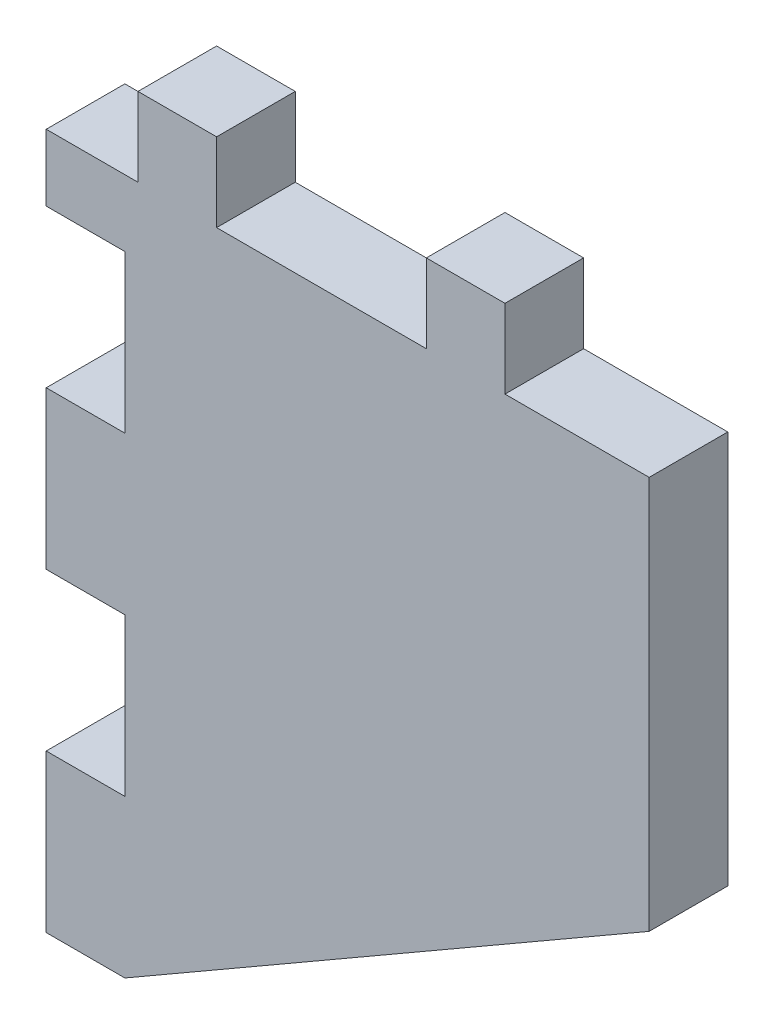
ISO-10303-21;
HEADER;
FILE_DESCRIPTION(('STEP AP214'),'2;1');
FILE_NAME('part.step','',(''),(''),'','','');
FILE_SCHEMA(('AUTOMOTIVE_DESIGN { 1 0 10303 214 1 1 1 1 }'));
ENDSEC;
DATA;
#1=APPLICATION_CONTEXT('core data for automotive mechanical design processes');
#2=APPLICATION_PROTOCOL_DEFINITION('international standard','automotive_design',2000,#1);
#3=PRODUCT_CONTEXT('',#1,'mechanical');
#4=PRODUCT('Part','Part','',(#3));
#5=PRODUCT_RELATED_PRODUCT_CATEGORY('part','',(#4));
#6=PRODUCT_DEFINITION_FORMATION('','',#4);
#7=PRODUCT_DEFINITION_CONTEXT('part definition',#1,'design');
#8=PRODUCT_DEFINITION('design','',#6,#7);
#9=PRODUCT_DEFINITION_SHAPE('','',#8);
#10=(LENGTH_UNIT() NAMED_UNIT(*) SI_UNIT(.MILLI.,.METRE.));
#11=(NAMED_UNIT(*) PLANE_ANGLE_UNIT() SI_UNIT($,.RADIAN.));
#12=(NAMED_UNIT(*) SI_UNIT($,.STERADIAN.) SOLID_ANGLE_UNIT());
#13=UNCERTAINTY_MEASURE_WITH_UNIT(LENGTH_MEASURE(1.E-05),#10,'distance_accuracy_value','');
#14=(GEOMETRIC_REPRESENTATION_CONTEXT(3) GLOBAL_UNCERTAINTY_ASSIGNED_CONTEXT((#13)) GLOBAL_UNIT_ASSIGNED_CONTEXT((#10,
#11,#12)) REPRESENTATION_CONTEXT('',''));
#15=CARTESIAN_POINT('',(0.,0.,0.));
#16=DIRECTION('',(0.,0.,1.));
#17=DIRECTION('',(1.,0.,0.));
#18=AXIS2_PLACEMENT_3D('',#15,#16,#17);
#19=CARTESIAN_POINT('',(-14.1266424451322,14.9295589069163,3.));
#20=DIRECTION('',(0.,-1.,0.));
#21=DIRECTION('',(1.,0.,0.));
#22=AXIS2_PLACEMENT_3D('',#19,#20,#21);
#23=PLANE('',#22);
#24=DIRECTION('',(0.,0.,1.));
#25=VECTOR('',#24,1.);
#26=CARTESIAN_POINT('',(-8.62664244513218,14.9295589069163,0.));
#27=LINE('',#26,#25);
#28=CARTESIAN_POINT('',(-8.62664244513218,14.9295589069163,0.));
#29=VERTEX_POINT('',#28);
#30=CARTESIAN_POINT('',(-8.62664244513218,14.9295589069163,3.));
#31=VERTEX_POINT('',#30);
#32=EDGE_CURVE('E192',#29,#31,#27,.T.);
#33=ORIENTED_EDGE('',*,*,#32,.F.);
#34=DIRECTION('',(-1.,0.,0.));
#35=VECTOR('',#34,1.);
#36=CARTESIAN_POINT('',(-14.1266424451322,14.9295589069163,0.));
#37=LINE('',#36,#35);
#38=CARTESIAN_POINT('',(-16.6266424451322,14.9295589069163,0.));
#39=VERTEX_POINT('',#38);
#40=EDGE_CURVE('E206',#29,#39,#37,.T.);
#41=ORIENTED_EDGE('',*,*,#40,.T.);
#42=DIRECTION('',(0.,0.,1.));
#43=VECTOR('',#42,1.);
#44=CARTESIAN_POINT('',(-16.6266424451322,14.9295589069163,0.));
#45=LINE('',#44,#43);
#46=CARTESIAN_POINT('',(-16.6266424451322,14.9295589069163,3.));
#47=VERTEX_POINT('',#46);
#48=EDGE_CURVE('E669',#39,#47,#45,.T.);
#49=ORIENTED_EDGE('',*,*,#48,.T.);
#50=DIRECTION('',(-1.,0.,0.));
#51=VECTOR('',#50,1.);
#52=CARTESIAN_POINT('',(-3.12664244513218,14.9295589069163,3.));
#53=LINE('',#52,#51);
#54=EDGE_CURVE('E208',#31,#47,#53,.T.);
#55=ORIENTED_EDGE('',*,*,#54,.F.);
#56=EDGE_LOOP('',(#33,#41,#49,#55));
#57=FACE_BOUND('',#56,.T.);
#58=ADVANCED_FACE('F45',(#57),#23,.F.);
#59=DIRECTION('',(0.,0.,1.));
#60=VECTOR('',#59,1.);
#61=CARTESIAN_POINT('',(-19.6266424451322,14.9295589069163,0.));
#62=LINE('',#61,#60);
#63=CARTESIAN_POINT('',(-19.6266424451322,14.9295589069163,0.));
#64=VERTEX_POINT('',#63);
#65=CARTESIAN_POINT('',(-19.6266424451322,14.9295589069163,3.));
#66=VERTEX_POINT('',#65);
#67=EDGE_CURVE('E666',#64,#66,#62,.T.);
#68=ORIENTED_EDGE('',*,*,#67,.F.);
#69=CARTESIAN_POINT('',(-23.1266424451322,14.9295589069163,0.));
#70=VERTEX_POINT('',#69);
#71=EDGE_CURVE('E220',#64,#70,#37,.T.);
#72=ORIENTED_EDGE('',*,*,#71,.T.);
#73=DIRECTION('',(0.,0.,-1.));
#74=VECTOR('',#73,1.);
#75=CARTESIAN_POINT('',(-23.1266424451322,14.9295589069163,3.));
#76=LINE('',#75,#74);
#77=CARTESIAN_POINT('',(-23.1266424451322,14.9295589069163,3.));
#78=VERTEX_POINT('',#77);
#79=EDGE_CURVE('E11',#78,#70,#76,.T.);
#80=ORIENTED_EDGE('',*,*,#79,.F.);
#81=EDGE_CURVE('E266',#66,#78,#53,.T.);
#82=ORIENTED_EDGE('',*,*,#81,.F.);
#83=EDGE_LOOP('',(#68,#72,#80,#82));
#84=FACE_BOUND('',#83,.T.);
#85=ADVANCED_FACE('F392',(#84),#23,.F.);
#86=CARTESIAN_POINT('',(-0.126642445132183,14.9295589069163,0.));
#87=VERTEX_POINT('',#86);
#88=CARTESIAN_POINT('',(-5.62664244513218,14.9295589069163,0.));
#89=VERTEX_POINT('',#88);
#90=EDGE_CURVE('E219',#87,#89,#37,.T.);
#91=ORIENTED_EDGE('',*,*,#90,.T.);
#92=DIRECTION('',(0.,0.,1.));
#93=VECTOR('',#92,1.);
#94=CARTESIAN_POINT('',(-5.62664244513218,14.9295589069163,0.));
#95=LINE('',#94,#93);
#96=CARTESIAN_POINT('',(-5.62664244513218,14.9295589069163,3.));
#97=VERTEX_POINT('',#96);
#98=EDGE_CURVE('E210',#89,#97,#95,.T.);
#99=ORIENTED_EDGE('',*,*,#98,.T.);
#100=CARTESIAN_POINT('',(-0.126642445132183,14.9295589069163,3.));
#101=VERTEX_POINT('',#100);
#102=EDGE_CURVE('E371',#101,#97,#53,.T.);
#103=ORIENTED_EDGE('',*,*,#102,.F.);
#104=DIRECTION('',(0.,0.,-1.));
#105=VECTOR('',#104,1.);
#106=CARTESIAN_POINT('',(-0.126642445132183,14.9295589069163,3.));
#107=LINE('',#106,#105);
#108=EDGE_CURVE('E267',#101,#87,#107,.T.);
#109=ORIENTED_EDGE('',*,*,#108,.T.);
#110=EDGE_LOOP('',(#91,#99,#103,#109));
#111=FACE_BOUND('',#110,.T.);
#112=ADVANCED_FACE('F47',(#111),#23,.F.);
#113=CARTESIAN_POINT('',(-23.1266424451322,14.9295589069163,3.));
#114=DIRECTION('',(1.,0.,0.));
#115=DIRECTION('',(0.,0.,-1.));
#116=AXIS2_PLACEMENT_3D('',#113,#114,#115);
#117=PLANE('',#116);
#118=DIRECTION('',(0.,-1.,0.));
#119=VECTOR('',#118,1.);
#120=CARTESIAN_POINT('',(-23.1266424451322,14.9295589069163,0.));
#121=LINE('',#120,#119);
#122=CARTESIAN_POINT('',(-23.1266424451322,12.3895589069163,0.));
#123=VERTEX_POINT('',#122);
#124=EDGE_CURVE('E225',#70,#123,#121,.T.);
#125=ORIENTED_EDGE('',*,*,#124,.T.);
#126=DIRECTION('',(0.,0.,-1.));
#127=VECTOR('',#126,1.);
#128=CARTESIAN_POINT('',(-23.1266424451322,12.3895589069163,3.));
#129=LINE('',#128,#127);
#130=CARTESIAN_POINT('',(-23.1266424451322,12.3895589069163,3.));
#131=VERTEX_POINT('',#130);
#132=EDGE_CURVE('E54',#131,#123,#129,.T.);
#133=ORIENTED_EDGE('',*,*,#132,.F.);
#134=DIRECTION('',(0.,-1.,0.));
#135=VECTOR('',#134,1.);
#136=CARTESIAN_POINT('',(-23.1266424451322,14.9295589069163,3.));
#137=LINE('',#136,#135);
#138=EDGE_CURVE('E377',#78,#131,#137,.T.);
#139=ORIENTED_EDGE('',*,*,#138,.F.);
#140=ORIENTED_EDGE('',*,*,#79,.T.);
#141=EDGE_LOOP('',(#125,#133,#139,#140));
#142=FACE_BOUND('',#141,.T.);
#143=ADVANCED_FACE('F393',(#142),#117,.F.);
#144=CARTESIAN_POINT('',(-23.1266424451322,12.3895589069163,3.));
#145=DIRECTION('',(0.,1.,0.));
#146=DIRECTION('',(0.,0.,1.));
#147=AXIS2_PLACEMENT_3D('',#144,#145,#146);
#148=PLANE('',#147);
#149=DIRECTION('',(1.,0.,0.));
#150=VECTOR('',#149,1.);
#151=CARTESIAN_POINT('',(-23.1266424451322,12.3895589069163,0.));
#152=LINE('',#151,#150);
#153=CARTESIAN_POINT('',(-20.1266424451322,12.3895589069163,0.));
#154=VERTEX_POINT('',#153);
#155=EDGE_CURVE('E232',#123,#154,#152,.T.);
#156=ORIENTED_EDGE('',*,*,#155,.T.);
#157=DIRECTION('',(0.,0.,-1.));
#158=VECTOR('',#157,1.);
#159=CARTESIAN_POINT('',(-20.1266424451322,12.3895589069163,3.));
#160=LINE('',#159,#158);
#161=CARTESIAN_POINT('',(-20.1266424451322,12.3895589069163,3.));
#162=VERTEX_POINT('',#161);
#163=EDGE_CURVE('E307',#162,#154,#160,.T.);
#164=ORIENTED_EDGE('',*,*,#163,.F.);
#165=DIRECTION('',(1.,0.,0.));
#166=VECTOR('',#165,1.);
#167=CARTESIAN_POINT('',(-23.1266424451322,12.3895589069163,3.));
#168=LINE('',#167,#166);
#169=EDGE_CURVE('E318',#131,#162,#168,.T.);
#170=ORIENTED_EDGE('',*,*,#169,.F.);
#171=ORIENTED_EDGE('',*,*,#132,.T.);
#172=EDGE_LOOP('',(#156,#164,#170,#171));
#173=FACE_BOUND('',#172,.T.);
#174=ADVANCED_FACE('F316',(#173),#148,.F.);
#175=CARTESIAN_POINT('',(-20.1266424451322,12.3895589069163,3.));
#176=DIRECTION('',(1.,0.,0.));
#177=DIRECTION('',(0.,0.,-1.));
#178=AXIS2_PLACEMENT_3D('',#175,#176,#177);
#179=PLANE('',#178);
#180=DIRECTION('',(0.,-1.,0.));
#181=VECTOR('',#180,1.);
#182=CARTESIAN_POINT('',(-20.1266424451322,12.3895589069163,0.));
#183=LINE('',#182,#181);
#184=CARTESIAN_POINT('',(-20.1266424451322,6.38955890691629,0.));
#185=VERTEX_POINT('',#184);
#186=EDGE_CURVE('E235',#154,#185,#183,.T.);
#187=ORIENTED_EDGE('',*,*,#186,.T.);
#188=DIRECTION('',(0.,0.,-1.));
#189=VECTOR('',#188,1.);
#190=CARTESIAN_POINT('',(-20.1266424451322,6.38955890691629,3.));
#191=LINE('',#190,#189);
#192=CARTESIAN_POINT('',(-20.1266424451322,6.38955890691629,3.));
#193=VERTEX_POINT('',#192);
#194=EDGE_CURVE('E303',#193,#185,#191,.T.);
#195=ORIENTED_EDGE('',*,*,#194,.F.);
#196=DIRECTION('',(0.,-1.,0.));
#197=VECTOR('',#196,1.);
#198=CARTESIAN_POINT('',(-20.1266424451322,12.3895589069163,3.));
#199=LINE('',#198,#197);
#200=EDGE_CURVE('E339',#162,#193,#199,.T.);
#201=ORIENTED_EDGE('',*,*,#200,.F.);
#202=ORIENTED_EDGE('',*,*,#163,.T.);
#203=EDGE_LOOP('',(#187,#195,#201,#202));
#204=FACE_BOUND('',#203,.T.);
#205=ADVANCED_FACE('F328',(#204),#179,.F.);
#206=CARTESIAN_POINT('',(-20.1266424451322,6.38955890691629,3.));
#207=DIRECTION('',(0.,-1.,0.));
#208=DIRECTION('',(1.,0.,0.));
#209=AXIS2_PLACEMENT_3D('',#206,#207,#208);
#210=PLANE('',#209);
#211=DIRECTION('',(-1.,0.,0.));
#212=VECTOR('',#211,1.);
#213=CARTESIAN_POINT('',(-20.1266424451322,6.38955890691629,0.));
#214=LINE('',#213,#212);
#215=CARTESIAN_POINT('',(-23.1266424451322,6.38955890691629,0.));
#216=VERTEX_POINT('',#215);
#217=EDGE_CURVE('E238',#185,#216,#214,.T.);
#218=ORIENTED_EDGE('',*,*,#217,.T.);
#219=DIRECTION('',(0.,0.,-1.));
#220=VECTOR('',#219,1.);
#221=CARTESIAN_POINT('',(-23.1266424451322,6.38955890691629,3.));
#222=LINE('',#221,#220);
#223=CARTESIAN_POINT('',(-23.1266424451322,6.38955890691629,3.));
#224=VERTEX_POINT('',#223);
#225=EDGE_CURVE('E299',#224,#216,#222,.T.);
#226=ORIENTED_EDGE('',*,*,#225,.F.);
#227=DIRECTION('',(-1.,0.,0.));
#228=VECTOR('',#227,1.);
#229=CARTESIAN_POINT('',(-20.1266424451322,6.38955890691629,3.));
#230=LINE('',#229,#228);
#231=EDGE_CURVE('E334',#193,#224,#230,.T.);
#232=ORIENTED_EDGE('',*,*,#231,.F.);
#233=ORIENTED_EDGE('',*,*,#194,.T.);
#234=EDGE_LOOP('',(#218,#226,#232,#233));
#235=FACE_BOUND('',#234,.T.);
#236=ADVANCED_FACE('F332',(#235),#210,.F.);
#237=CARTESIAN_POINT('',(-23.1266424451322,6.38955890691629,3.));
#238=DIRECTION('',(1.,0.,0.));
#239=DIRECTION('',(0.,0.,-1.));
#240=AXIS2_PLACEMENT_3D('',#237,#238,#239);
#241=PLANE('',#240);
#242=DIRECTION('',(0.,-1.,0.));
#243=VECTOR('',#242,1.);
#244=CARTESIAN_POINT('',(-23.1266424451322,6.38955890691629,0.));
#245=LINE('',#244,#243);
#246=CARTESIAN_POINT('',(-23.1266424451322,0.38955890691629,0.));
#247=VERTEX_POINT('',#246);
#248=EDGE_CURVE('E241',#216,#247,#245,.T.);
#249=ORIENTED_EDGE('',*,*,#248,.T.);
#250=DIRECTION('',(0.,0.,-1.));
#251=VECTOR('',#250,1.);
#252=CARTESIAN_POINT('',(-23.1266424451322,0.38955890691629,3.));
#253=LINE('',#252,#251);
#254=CARTESIAN_POINT('',(-23.1266424451322,0.38955890691629,3.));
#255=VERTEX_POINT('',#254);
#256=EDGE_CURVE('E295',#255,#247,#253,.T.);
#257=ORIENTED_EDGE('',*,*,#256,.F.);
#258=DIRECTION('',(0.,-1.,0.));
#259=VECTOR('',#258,1.);
#260=CARTESIAN_POINT('',(-23.1266424451322,6.38955890691629,3.));
#261=LINE('',#260,#259);
#262=EDGE_CURVE('E338',#224,#255,#261,.T.);
#263=ORIENTED_EDGE('',*,*,#262,.F.);
#264=ORIENTED_EDGE('',*,*,#225,.T.);
#265=EDGE_LOOP('',(#249,#257,#263,#264));
#266=FACE_BOUND('',#265,.T.);
#267=ADVANCED_FACE('F564',(#266),#241,.F.);
#268=CARTESIAN_POINT('',(-23.1266424451322,0.38955890691629,3.));
#269=DIRECTION('',(0.,1.,0.));
#270=DIRECTION('',(0.,0.,1.));
#271=AXIS2_PLACEMENT_3D('',#268,#269,#270);
#272=PLANE('',#271);
#273=DIRECTION('',(1.,0.,0.));
#274=VECTOR('',#273,1.);
#275=CARTESIAN_POINT('',(-23.1266424451322,0.38955890691629,0.));
#276=LINE('',#275,#274);
#277=CARTESIAN_POINT('',(-20.1266424451322,0.38955890691629,0.));
#278=VERTEX_POINT('',#277);
#279=EDGE_CURVE('E244',#247,#278,#276,.T.);
#280=ORIENTED_EDGE('',*,*,#279,.T.);
#281=DIRECTION('',(0.,0.,-1.));
#282=VECTOR('',#281,1.);
#283=CARTESIAN_POINT('',(-20.1266424451322,0.38955890691629,3.));
#284=LINE('',#283,#282);
#285=CARTESIAN_POINT('',(-20.1266424451322,0.38955890691629,3.));
#286=VERTEX_POINT('',#285);
#287=EDGE_CURVE('E291',#286,#278,#284,.T.);
#288=ORIENTED_EDGE('',*,*,#287,.F.);
#289=DIRECTION('',(1.,0.,0.));
#290=VECTOR('',#289,1.);
#291=CARTESIAN_POINT('',(-23.1266424451322,0.38955890691629,3.));
#292=LINE('',#291,#290);
#293=EDGE_CURVE('E343',#255,#286,#292,.T.);
#294=ORIENTED_EDGE('',*,*,#293,.F.);
#295=ORIENTED_EDGE('',*,*,#256,.T.);
#296=EDGE_LOOP('',(#280,#288,#294,#295));
#297=FACE_BOUND('',#296,.T.);
#298=ADVANCED_FACE('F555',(#297),#272,.F.);
#299=CARTESIAN_POINT('',(-20.1266424451322,0.38955890691629,3.));
#300=DIRECTION('',(1.,0.,0.));
#301=DIRECTION('',(0.,0.,-1.));
#302=AXIS2_PLACEMENT_3D('',#299,#300,#301);
#303=PLANE('',#302);
#304=DIRECTION('',(0.,-1.,0.));
#305=VECTOR('',#304,1.);
#306=CARTESIAN_POINT('',(-20.1266424451322,0.38955890691629,0.));
#307=LINE('',#306,#305);
#308=CARTESIAN_POINT('',(-20.1266424451322,-5.6104410930837,0.));
#309=VERTEX_POINT('',#308);
#310=EDGE_CURVE('E247',#278,#309,#307,.T.);
#311=ORIENTED_EDGE('',*,*,#310,.T.);
#312=DIRECTION('',(0.,0.,-1.));
#313=VECTOR('',#312,1.);
#314=CARTESIAN_POINT('',(-20.1266424451322,-5.6104410930837,3.));
#315=LINE('',#314,#313);
#316=CARTESIAN_POINT('',(-20.1266424451322,-5.6104410930837,3.));
#317=VERTEX_POINT('',#316);
#318=EDGE_CURVE('E287',#317,#309,#315,.T.);
#319=ORIENTED_EDGE('',*,*,#318,.F.);
#320=DIRECTION('',(0.,-1.,0.));
#321=VECTOR('',#320,1.);
#322=CARTESIAN_POINT('',(-20.1266424451322,0.38955890691629,3.));
#323=LINE('',#322,#321);
#324=EDGE_CURVE('E350',#286,#317,#323,.T.);
#325=ORIENTED_EDGE('',*,*,#324,.F.);
#326=ORIENTED_EDGE('',*,*,#287,.T.);
#327=EDGE_LOOP('',(#311,#319,#325,#326));
#328=FACE_BOUND('',#327,.T.);
#329=ADVANCED_FACE('F546',(#328),#303,.F.);
#330=CARTESIAN_POINT('',(-20.1266424451322,-5.6104410930837,3.));
#331=DIRECTION('',(0.,-1.,0.));
#332=DIRECTION('',(1.,0.,0.));
#333=AXIS2_PLACEMENT_3D('',#330,#331,#332);
#334=PLANE('',#333);
#335=DIRECTION('',(-1.,0.,0.));
#336=VECTOR('',#335,1.);
#337=CARTESIAN_POINT('',(-20.1266424451322,-5.6104410930837,0.));
#338=LINE('',#337,#336);
#339=CARTESIAN_POINT('',(-23.1266424451322,-5.61044109308371,0.));
#340=VERTEX_POINT('',#339);
#341=EDGE_CURVE('E250',#309,#340,#338,.T.);
#342=ORIENTED_EDGE('',*,*,#341,.T.);
#343=DIRECTION('',(0.,0.,-1.));
#344=VECTOR('',#343,1.);
#345=CARTESIAN_POINT('',(-23.1266424451322,-5.61044109308371,3.));
#346=LINE('',#345,#344);
#347=CARTESIAN_POINT('',(-23.1266424451322,-5.61044109308371,3.));
#348=VERTEX_POINT('',#347);
#349=EDGE_CURVE('E283',#348,#340,#346,.T.);
#350=ORIENTED_EDGE('',*,*,#349,.F.);
#351=DIRECTION('',(-1.,0.,0.));
#352=VECTOR('',#351,1.);
#353=CARTESIAN_POINT('',(-20.1266424451322,-5.6104410930837,3.));
#354=LINE('',#353,#352);
#355=EDGE_CURVE('E353',#317,#348,#354,.T.);
#356=ORIENTED_EDGE('',*,*,#355,.F.);
#357=ORIENTED_EDGE('',*,*,#318,.T.);
#358=EDGE_LOOP('',(#342,#350,#356,#357));
#359=FACE_BOUND('',#358,.T.);
#360=ADVANCED_FACE('F537',(#359),#334,.F.);
#361=CARTESIAN_POINT('',(-23.1266424451322,-5.61044109308371,3.));
#362=DIRECTION('',(1.,0.,0.));
#363=DIRECTION('',(0.,0.,-1.));
#364=AXIS2_PLACEMENT_3D('',#361,#362,#363);
#365=PLANE('',#364);
#366=DIRECTION('',(0.,-1.,0.));
#367=VECTOR('',#366,1.);
#368=CARTESIAN_POINT('',(-23.1266424451322,-5.61044109308371,0.));
#369=LINE('',#368,#367);
#370=CARTESIAN_POINT('',(-23.1266424451322,-11.6104410930837,0.));
#371=VERTEX_POINT('',#370);
#372=EDGE_CURVE('E253',#340,#371,#369,.T.);
#373=ORIENTED_EDGE('',*,*,#372,.T.);
#374=DIRECTION('',(0.,0.,-1.));
#375=VECTOR('',#374,1.);
#376=CARTESIAN_POINT('',(-23.1266424451322,-11.6104410930837,3.));
#377=LINE('',#376,#375);
#378=CARTESIAN_POINT('',(-23.1266424451322,-11.6104410930837,3.));
#379=VERTEX_POINT('',#378);
#380=EDGE_CURVE('E279',#379,#371,#377,.T.);
#381=ORIENTED_EDGE('',*,*,#380,.F.);
#382=DIRECTION('',(0.,-1.,0.));
#383=VECTOR('',#382,1.);
#384=CARTESIAN_POINT('',(-23.1266424451322,-5.61044109308371,3.));
#385=LINE('',#384,#383);
#386=EDGE_CURVE('E356',#348,#379,#385,.T.);
#387=ORIENTED_EDGE('',*,*,#386,.F.);
#388=ORIENTED_EDGE('',*,*,#349,.T.);
#389=EDGE_LOOP('',(#373,#381,#387,#388));
#390=FACE_BOUND('',#389,.T.);
#391=ADVANCED_FACE('F528',(#390),#365,.F.);
#392=CARTESIAN_POINT('',(-23.1266424451322,-11.6104410930837,3.));
#393=DIRECTION('',(0.,1.,0.));
#394=DIRECTION('',(0.,0.,1.));
#395=AXIS2_PLACEMENT_3D('',#392,#393,#394);
#396=PLANE('',#395);
#397=DIRECTION('',(1.,0.,0.));
#398=VECTOR('',#397,1.);
#399=CARTESIAN_POINT('',(-23.1266424451322,-11.6104410930837,0.));
#400=LINE('',#399,#398);
#401=CARTESIAN_POINT('',(-20.1266424451322,-11.6104410930837,0.));
#402=VERTEX_POINT('',#401);
#403=EDGE_CURVE('E256',#371,#402,#400,.T.);
#404=ORIENTED_EDGE('',*,*,#403,.T.);
#405=DIRECTION('',(0.,0.,-1.));
#406=VECTOR('',#405,1.);
#407=CARTESIAN_POINT('',(-20.1266424451322,-11.6104410930837,3.));
#408=LINE('',#407,#406);
#409=CARTESIAN_POINT('',(-20.1266424451322,-11.6104410930837,3.));
#410=VERTEX_POINT('',#409);
#411=EDGE_CURVE('E275',#410,#402,#408,.T.);
#412=ORIENTED_EDGE('',*,*,#411,.F.);
#413=DIRECTION('',(1.,0.,0.));
#414=VECTOR('',#413,1.);
#415=CARTESIAN_POINT('',(-23.1266424451322,-11.6104410930837,3.));
#416=LINE('',#415,#414);
#417=EDGE_CURVE('E359',#379,#410,#416,.T.);
#418=ORIENTED_EDGE('',*,*,#417,.F.);
#419=ORIENTED_EDGE('',*,*,#380,.T.);
#420=EDGE_LOOP('',(#404,#412,#418,#419));
#421=FACE_BOUND('',#420,.T.);
#422=ADVANCED_FACE('F519',(#421),#396,.F.);
#423=CARTESIAN_POINT('',(-20.1266424451322,-11.6104410930837,3.));
#424=DIRECTION('',(-0.499772441725888,0.866156744758905,0.));
#425=DIRECTION('',(-0.866156744758905,-0.499772441725889,0.));
#426=AXIS2_PLACEMENT_3D('',#423,#424,#425);
#427=PLANE('',#426);
#428=DIRECTION('',(0.866156744758905,0.499772441725889,0.));
#429=VECTOR('',#428,1.);
#430=CARTESIAN_POINT('',(-20.1266424451322,-11.6104410930837,0.));
#431=LINE('',#430,#429);
#432=CARTESIAN_POINT('',(-0.126642445132181,-0.0704410930837084,0.));
#433=VERTEX_POINT('',#432);
#434=EDGE_CURVE('E259',#402,#433,#431,.T.);
#435=ORIENTED_EDGE('',*,*,#434,.T.);
#436=DIRECTION('',(0.,0.,-1.));
#437=VECTOR('',#436,1.);
#438=CARTESIAN_POINT('',(-0.126642445132181,-0.0704410930837084,3.));
#439=LINE('',#438,#437);
#440=CARTESIAN_POINT('',(-0.126642445132181,-0.0704410930837084,3.));
#441=VERTEX_POINT('',#440);
#442=EDGE_CURVE('E271',#441,#433,#439,.T.);
#443=ORIENTED_EDGE('',*,*,#442,.F.);
#444=DIRECTION('',(0.866156744758905,0.499772441725889,0.));
#445=VECTOR('',#444,1.);
#446=CARTESIAN_POINT('',(-20.1266424451322,-11.6104410930837,3.));
#447=LINE('',#446,#445);
#448=EDGE_CURVE('E361',#410,#441,#447,.T.);
#449=ORIENTED_EDGE('',*,*,#448,.F.);
#450=ORIENTED_EDGE('',*,*,#411,.T.);
#451=EDGE_LOOP('',(#435,#443,#449,#450));
#452=FACE_BOUND('',#451,.T.);
#453=ADVANCED_FACE('F511',(#452),#427,.F.);
#454=CARTESIAN_POINT('',(-0.126642445132183,14.9295589069163,3.));
#455=DIRECTION('',(-1.,0.,0.));
#456=DIRECTION('',(0.,-1.,0.));
#457=AXIS2_PLACEMENT_3D('',#454,#455,#456);
#458=PLANE('',#457);
#459=DIRECTION('',(0.,1.,0.));
#460=VECTOR('',#459,1.);
#461=CARTESIAN_POINT('',(-0.126642445132183,14.9295589069163,0.));
#462=LINE('',#461,#460);
#463=EDGE_CURVE('E262',#433,#87,#462,.T.);
#464=ORIENTED_EDGE('',*,*,#463,.T.);
#465=ORIENTED_EDGE('',*,*,#108,.F.);
#466=DIRECTION('',(0.,1.,0.));
#467=VECTOR('',#466,1.);
#468=CARTESIAN_POINT('',(-0.126642445132183,14.9295589069163,3.));
#469=LINE('',#468,#467);
#470=EDGE_CURVE('E228',#441,#101,#469,.T.);
#471=ORIENTED_EDGE('',*,*,#470,.F.);
#472=ORIENTED_EDGE('',*,*,#442,.T.);
#473=EDGE_LOOP('',(#464,#465,#471,#472));
#474=FACE_BOUND('',#473,.T.);
#475=ADVANCED_FACE('F373',(#474),#458,.F.);
#476=CARTESIAN_POINT('',(0.,0.,3.));
#477=DIRECTION('',(0.,0.,-1.));
#478=DIRECTION('',(-1.,0.,0.));
#479=AXIS2_PLACEMENT_3D('',#476,#477,#478);
#480=PLANE('',#479);
#481=ORIENTED_EDGE('',*,*,#102,.T.);
#482=DIRECTION('',(0.,1.,0.));
#483=VECTOR('',#482,1.);
#484=CARTESIAN_POINT('',(-5.62664244513218,14.9295589069163,3.));
#485=LINE('',#484,#483);
#486=CARTESIAN_POINT('',(-5.62664244513218,17.9295589069163,3.));
#487=VERTEX_POINT('',#486);
#488=EDGE_CURVE('E69',#97,#487,#485,.T.);
#489=ORIENTED_EDGE('',*,*,#488,.T.);
#490=DIRECTION('',(-1.,0.,0.));
#491=VECTOR('',#490,1.);
#492=CARTESIAN_POINT('',(-5.62664244513218,17.9295589069163,3.));
#493=LINE('',#492,#491);
#494=CARTESIAN_POINT('',(-8.62664244513218,17.9295589069163,3.));
#495=VERTEX_POINT('',#494);
#496=EDGE_CURVE('E201',#487,#495,#493,.T.);
#497=ORIENTED_EDGE('',*,*,#496,.T.);
#498=DIRECTION('',(0.,-1.,0.));
#499=VECTOR('',#498,1.);
#500=CARTESIAN_POINT('',(-8.62664244513218,14.9295589069163,3.));
#501=LINE('',#500,#499);
#502=EDGE_CURVE('E644',#495,#31,#501,.T.);
#503=ORIENTED_EDGE('',*,*,#502,.T.);
#504=ORIENTED_EDGE('',*,*,#54,.T.);
#505=DIRECTION('',(0.,1.,0.));
#506=VECTOR('',#505,1.);
#507=CARTESIAN_POINT('',(-16.6266424451322,14.9295589069163,3.));
#508=LINE('',#507,#506);
#509=CARTESIAN_POINT('',(-16.6266424451322,17.9295589069163,3.));
#510=VERTEX_POINT('',#509);
#511=EDGE_CURVE('E61',#47,#510,#508,.T.);
#512=ORIENTED_EDGE('',*,*,#511,.T.);
#513=DIRECTION('',(-1.,0.,0.));
#514=VECTOR('',#513,1.);
#515=CARTESIAN_POINT('',(-16.6266424451322,17.9295589069163,3.));
#516=LINE('',#515,#514);
#517=CARTESIAN_POINT('',(-19.6266424451322,17.9295589069163,3.));
#518=VERTEX_POINT('',#517);
#519=EDGE_CURVE('E674',#510,#518,#516,.T.);
#520=ORIENTED_EDGE('',*,*,#519,.T.);
#521=DIRECTION('',(0.,-1.,0.));
#522=VECTOR('',#521,1.);
#523=CARTESIAN_POINT('',(-19.6266424451322,14.9295589069163,3.));
#524=LINE('',#523,#522);
#525=EDGE_CURVE('E389',#518,#66,#524,.T.);
#526=ORIENTED_EDGE('',*,*,#525,.T.);
#527=ORIENTED_EDGE('',*,*,#81,.T.);
#528=ORIENTED_EDGE('',*,*,#138,.T.);
#529=ORIENTED_EDGE('',*,*,#169,.T.);
#530=ORIENTED_EDGE('',*,*,#200,.T.);
#531=ORIENTED_EDGE('',*,*,#231,.T.);
#532=ORIENTED_EDGE('',*,*,#262,.T.);
#533=ORIENTED_EDGE('',*,*,#293,.T.);
#534=ORIENTED_EDGE('',*,*,#324,.T.);
#535=ORIENTED_EDGE('',*,*,#355,.T.);
#536=ORIENTED_EDGE('',*,*,#386,.T.);
#537=ORIENTED_EDGE('',*,*,#417,.T.);
#538=ORIENTED_EDGE('',*,*,#448,.T.);
#539=ORIENTED_EDGE('',*,*,#470,.T.);
#540=EDGE_LOOP('',(#481,#489,#497,#503,#504,#512,#520,#526,#527,#528,#529,#530,#531,#532,#533,
#534,#535,#536,#537,#538,#539));
#541=FACE_BOUND('',#540,.T.);
#542=ADVANCED_FACE('F369',(#541),#480,.F.);
#543=CARTESIAN_POINT('',(0.,0.,0.));
#544=DIRECTION('',(0.,0.,-1.));
#545=DIRECTION('',(-1.,0.,0.));
#546=AXIS2_PLACEMENT_3D('',#543,#544,#545);
#547=PLANE('',#546);
#548=ORIENTED_EDGE('',*,*,#90,.F.);
#549=ORIENTED_EDGE('',*,*,#463,.F.);
#550=ORIENTED_EDGE('',*,*,#434,.F.);
#551=ORIENTED_EDGE('',*,*,#403,.F.);
#552=ORIENTED_EDGE('',*,*,#372,.F.);
#553=ORIENTED_EDGE('',*,*,#341,.F.);
#554=ORIENTED_EDGE('',*,*,#310,.F.);
#555=ORIENTED_EDGE('',*,*,#279,.F.);
#556=ORIENTED_EDGE('',*,*,#248,.F.);
#557=ORIENTED_EDGE('',*,*,#217,.F.);
#558=ORIENTED_EDGE('',*,*,#186,.F.);
#559=ORIENTED_EDGE('',*,*,#155,.F.);
#560=ORIENTED_EDGE('',*,*,#124,.F.);
#561=ORIENTED_EDGE('',*,*,#71,.F.);
#562=DIRECTION('',(0.,-1.,0.));
#563=VECTOR('',#562,1.);
#564=CARTESIAN_POINT('',(-19.6266424451322,14.9295589069163,0.));
#565=LINE('',#564,#563);
#566=CARTESIAN_POINT('',(-19.6266424451322,17.9295589069163,0.));
#567=VERTEX_POINT('',#566);
#568=EDGE_CURVE('E662',#567,#64,#565,.T.);
#569=ORIENTED_EDGE('',*,*,#568,.F.);
#570=DIRECTION('',(-1.,0.,0.));
#571=VECTOR('',#570,1.);
#572=CARTESIAN_POINT('',(-16.6266424451322,17.9295589069163,0.));
#573=LINE('',#572,#571);
#574=CARTESIAN_POINT('',(-16.6266424451322,17.9295589069163,0.));
#575=VERTEX_POINT('',#574);
#576=EDGE_CURVE('E681',#575,#567,#573,.T.);
#577=ORIENTED_EDGE('',*,*,#576,.F.);
#578=DIRECTION('',(0.,1.,0.));
#579=VECTOR('',#578,1.);
#580=CARTESIAN_POINT('',(-16.6266424451322,14.9295589069163,0.));
#581=LINE('',#580,#579);
#582=EDGE_CURVE('E217',#39,#575,#581,.T.);
#583=ORIENTED_EDGE('',*,*,#582,.F.);
#584=ORIENTED_EDGE('',*,*,#40,.F.);
#585=DIRECTION('',(0.,-1.,0.));
#586=VECTOR('',#585,1.);
#587=CARTESIAN_POINT('',(-8.62664244513218,14.9295589069163,0.));
#588=LINE('',#587,#586);
#589=CARTESIAN_POINT('',(-8.62664244513218,17.9295589069163,0.));
#590=VERTEX_POINT('',#589);
#591=EDGE_CURVE('E188',#590,#29,#588,.T.);
#592=ORIENTED_EDGE('',*,*,#591,.F.);
#593=DIRECTION('',(-1.,0.,0.));
#594=VECTOR('',#593,1.);
#595=CARTESIAN_POINT('',(-5.62664244513218,17.9295589069163,0.));
#596=LINE('',#595,#594);
#597=CARTESIAN_POINT('',(-5.62664244513218,17.9295589069163,0.));
#598=VERTEX_POINT('',#597);
#599=EDGE_CURVE('E211',#598,#590,#596,.T.);
#600=ORIENTED_EDGE('',*,*,#599,.F.);
#601=DIRECTION('',(0.,1.,0.));
#602=VECTOR('',#601,1.);
#603=CARTESIAN_POINT('',(-5.62664244513218,14.9295589069163,0.));
#604=LINE('',#603,#602);
#605=EDGE_CURVE('E200',#89,#598,#604,.T.);
#606=ORIENTED_EDGE('',*,*,#605,.F.);
#607=EDGE_LOOP('',(#548,#549,#550,#551,#552,#553,#554,#555,#556,#557,#558,#559,#560,#561,#569,
#577,#583,#584,#592,#600,#606));
#608=FACE_BOUND('',#607,.T.);
#609=ADVANCED_FACE('F214',(#608),#547,.T.);
#610=CARTESIAN_POINT('',(-16.6266424451322,14.9295589069163,0.));
#611=DIRECTION('',(1.,0.,0.));
#612=DIRECTION('',(0.,0.,-1.));
#613=AXIS2_PLACEMENT_3D('',#610,#611,#612);
#614=PLANE('',#613);
#615=ORIENTED_EDGE('',*,*,#511,.F.);
#616=ORIENTED_EDGE('',*,*,#48,.F.);
#617=ORIENTED_EDGE('',*,*,#582,.T.);
#618=DIRECTION('',(0.,0.,1.));
#619=VECTOR('',#618,1.);
#620=CARTESIAN_POINT('',(-16.6266424451322,17.9295589069163,0.));
#621=LINE('',#620,#619);
#622=EDGE_CURVE('E659',#575,#510,#621,.T.);
#623=ORIENTED_EDGE('',*,*,#622,.T.);
#624=EDGE_LOOP('',(#615,#616,#617,#623));
#625=FACE_BOUND('',#624,.T.);
#626=ADVANCED_FACE('F428',(#625),#614,.T.);
#627=CARTESIAN_POINT('',(-19.6266424451322,14.9295589069163,0.));
#628=DIRECTION('',(-1.,0.,0.));
#629=DIRECTION('',(0.,0.,1.));
#630=AXIS2_PLACEMENT_3D('',#627,#628,#629);
#631=PLANE('',#630);
#632=ORIENTED_EDGE('',*,*,#525,.F.);
#633=DIRECTION('',(0.,0.,1.));
#634=VECTOR('',#633,1.);
#635=CARTESIAN_POINT('',(-19.6266424451322,17.9295589069163,0.));
#636=LINE('',#635,#634);
#637=EDGE_CURVE('E663',#567,#518,#636,.T.);
#638=ORIENTED_EDGE('',*,*,#637,.F.);
#639=ORIENTED_EDGE('',*,*,#568,.T.);
#640=ORIENTED_EDGE('',*,*,#67,.T.);
#641=EDGE_LOOP('',(#632,#638,#639,#640));
#642=FACE_BOUND('',#641,.T.);
#643=ADVANCED_FACE('F435',(#642),#631,.T.);
#644=CARTESIAN_POINT('',(-16.6266424451322,17.9295589069163,0.));
#645=DIRECTION('',(0.,1.,0.));
#646=DIRECTION('',(0.,0.,1.));
#647=AXIS2_PLACEMENT_3D('',#644,#645,#646);
#648=PLANE('',#647);
#649=ORIENTED_EDGE('',*,*,#519,.F.);
#650=ORIENTED_EDGE('',*,*,#622,.F.);
#651=ORIENTED_EDGE('',*,*,#576,.T.);
#652=ORIENTED_EDGE('',*,*,#637,.T.);
#653=EDGE_LOOP('',(#649,#650,#651,#652));
#654=FACE_BOUND('',#653,.T.);
#655=ADVANCED_FACE('F443',(#654),#648,.T.);
#656=CARTESIAN_POINT('',(-8.62664244513218,14.9295589069163,0.));
#657=DIRECTION('',(-1.,0.,0.));
#658=DIRECTION('',(0.,0.,1.));
#659=AXIS2_PLACEMENT_3D('',#656,#657,#658);
#660=PLANE('',#659);
#661=ORIENTED_EDGE('',*,*,#502,.F.);
#662=DIRECTION('',(0.,0.,1.));
#663=VECTOR('',#662,1.);
#664=CARTESIAN_POINT('',(-8.62664244513218,17.9295589069163,0.));
#665=LINE('',#664,#663);
#666=EDGE_CURVE('E194',#590,#495,#665,.T.);
#667=ORIENTED_EDGE('',*,*,#666,.F.);
#668=ORIENTED_EDGE('',*,*,#591,.T.);
#669=ORIENTED_EDGE('',*,*,#32,.T.);
#670=EDGE_LOOP('',(#661,#667,#668,#669));
#671=FACE_BOUND('',#670,.T.);
#672=ADVANCED_FACE('F191',(#671),#660,.T.);
#673=CARTESIAN_POINT('',(-5.62664244513218,17.9295589069163,0.));
#674=DIRECTION('',(0.,1.,0.));
#675=DIRECTION('',(0.,0.,1.));
#676=AXIS2_PLACEMENT_3D('',#673,#674,#675);
#677=PLANE('',#676);
#678=ORIENTED_EDGE('',*,*,#496,.F.);
#679=DIRECTION('',(0.,0.,1.));
#680=VECTOR('',#679,1.);
#681=CARTESIAN_POINT('',(-5.62664244513218,17.9295589069163,0.));
#682=LINE('',#681,#680);
#683=EDGE_CURVE('E654',#598,#487,#682,.T.);
#684=ORIENTED_EDGE('',*,*,#683,.F.);
#685=ORIENTED_EDGE('',*,*,#599,.T.);
#686=ORIENTED_EDGE('',*,*,#666,.T.);
#687=EDGE_LOOP('',(#678,#684,#685,#686));
#688=FACE_BOUND('',#687,.T.);
#689=ADVANCED_FACE('F460',(#688),#677,.T.);
#690=CARTESIAN_POINT('',(-5.62664244513218,14.9295589069163,0.));
#691=DIRECTION('',(1.,0.,0.));
#692=DIRECTION('',(0.,0.,-1.));
#693=AXIS2_PLACEMENT_3D('',#690,#691,#692);
#694=PLANE('',#693);
#695=ORIENTED_EDGE('',*,*,#488,.F.);
#696=ORIENTED_EDGE('',*,*,#98,.F.);
#697=ORIENTED_EDGE('',*,*,#605,.T.);
#698=ORIENTED_EDGE('',*,*,#683,.T.);
#699=EDGE_LOOP('',(#695,#696,#697,#698));
#700=FACE_BOUND('',#699,.T.);
#701=ADVANCED_FACE('F468',(#700),#694,.T.);
#702=CLOSED_SHELL('',(#58,#85,#112,#143,#174,#205,#236,#267,#298,#329,#360,#391,#422,#453,#475,
#542,#609,#626,#643,#655,#672,#689,#701));
#703=MANIFOLD_SOLID_BREP('B2',#702);
#704=ADVANCED_BREP_SHAPE_REPRESENTATION('',(#18,#703),#14);
#705=SHAPE_DEFINITION_REPRESENTATION(#9,#704);
ENDSEC;
END-ISO-10303-21;
